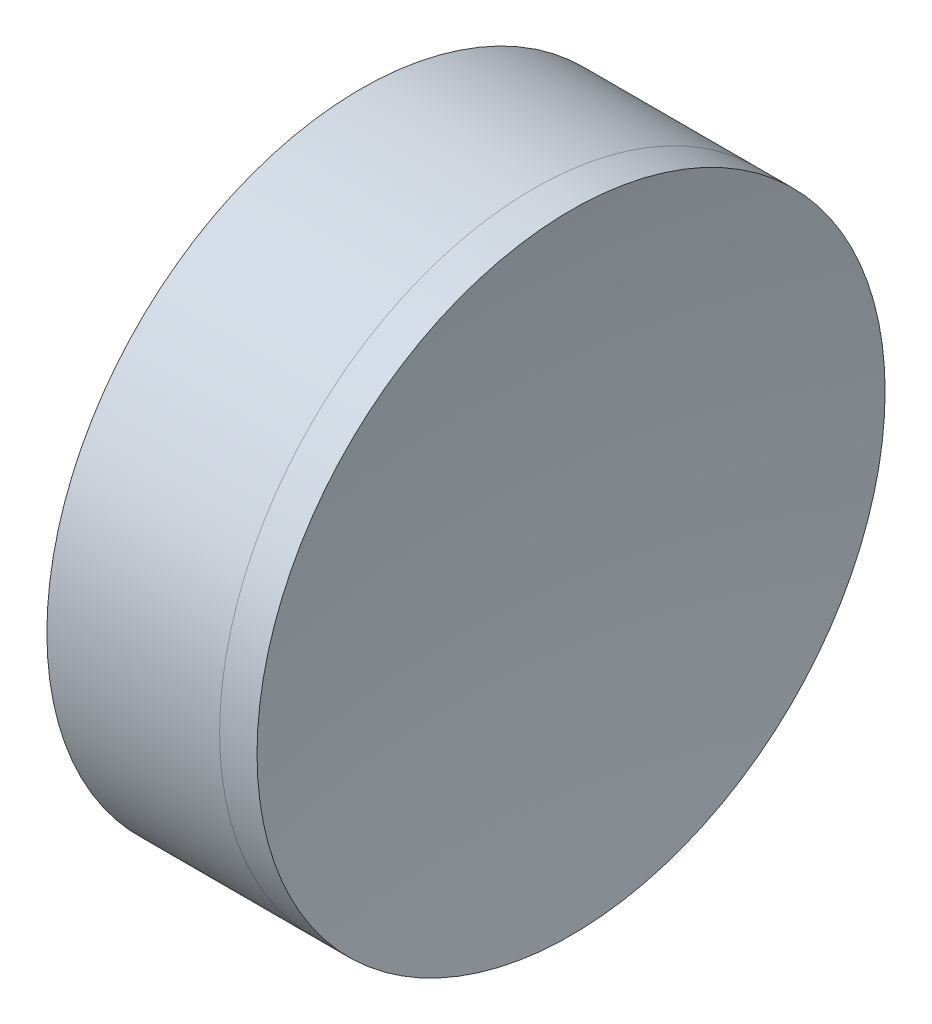
ISO-10303-21;
HEADER;
FILE_DESCRIPTION(('STEP AP214'),'2;1');
FILE_NAME('part.step','',(''),(''),'','','');
FILE_SCHEMA(('AUTOMOTIVE_DESIGN { 1 0 10303 214 1 1 1 1 }'));
ENDSEC;
DATA;
#1=APPLICATION_CONTEXT('core data for automotive mechanical design processes');
#2=APPLICATION_PROTOCOL_DEFINITION('international standard','automotive_design',2000,#1);
#3=PRODUCT_CONTEXT('',#1,'mechanical');
#4=PRODUCT('Part','Part','',(#3));
#5=PRODUCT_RELATED_PRODUCT_CATEGORY('part','',(#4));
#6=PRODUCT_DEFINITION_FORMATION('','',#4);
#7=PRODUCT_DEFINITION_CONTEXT('part definition',#1,'design');
#8=PRODUCT_DEFINITION('design','',#6,#7);
#9=PRODUCT_DEFINITION_SHAPE('','',#8);
#10=(LENGTH_UNIT() NAMED_UNIT(*) SI_UNIT(.MILLI.,.METRE.));
#11=(NAMED_UNIT(*) PLANE_ANGLE_UNIT() SI_UNIT($,.RADIAN.));
#12=(NAMED_UNIT(*) SI_UNIT($,.STERADIAN.) SOLID_ANGLE_UNIT());
#13=UNCERTAINTY_MEASURE_WITH_UNIT(LENGTH_MEASURE(1.E-05),#10,'distance_accuracy_value','');
#14=(GEOMETRIC_REPRESENTATION_CONTEXT(3) GLOBAL_UNCERTAINTY_ASSIGNED_CONTEXT((#13)) GLOBAL_UNIT_ASSIGNED_CONTEXT((#10,
#11,#12)) REPRESENTATION_CONTEXT('',''));
#15=CARTESIAN_POINT('',(0.,0.,0.));
#16=DIRECTION('',(0.,0.,1.));
#17=DIRECTION('',(1.,0.,0.));
#18=AXIS2_PLACEMENT_3D('',#15,#16,#17);
#19=CARTESIAN_POINT('',(297.310994613821,0.,0.));
#20=DIRECTION('',(-1.,0.,0.));
#21=DIRECTION('',(0.,0.,-1.));
#22=AXIS2_PLACEMENT_3D('',#19,#20,#21);
#23=SPHERICAL_SURFACE('',#22,40.9);
#24=CARTESIAN_POINT('',(261.634531784667,0.,0.));
#25=DIRECTION('',(-1.,0.,0.));
#26=DIRECTION('',(0.,0.,1.));
#27=AXIS2_PLACEMENT_3D('',#24,#25,#26);
#28=CIRCLE('',#27,20.);
#29=CARTESIAN_POINT('',(261.634531784667,0.,20.));
#30=VERTEX_POINT('',#29);
#31=EDGE_CURVE('E11',#30,#30,#28,.T.);
#32=ORIENTED_EDGE('',*,*,#31,.T.);
#33=EDGE_LOOP('',(#32));
#34=FACE_BOUND('',#33,.T.);
#35=ADVANCED_FACE('F45',(#34),#23,.T.);
#36=CARTESIAN_POINT('',(250.633803890604,0.,0.));
#37=DIRECTION('',(-1.,0.,0.));
#38=DIRECTION('',(0.,0.,1.));
#39=AXIS2_PLACEMENT_3D('',#36,#37,#38);
#40=CYLINDRICAL_SURFACE('',#39,20.);
#41=CARTESIAN_POINT('',(264.015516295071,0.,0.));
#42=DIRECTION('',(-1.,0.,0.));
#43=DIRECTION('',(0.,0.,1.));
#44=AXIS2_PLACEMENT_3D('',#41,#42,#43);
#45=CIRCLE('',#44,20.);
#46=CARTESIAN_POINT('',(264.015516295071,0.,20.));
#47=VERTEX_POINT('',#46);
#48=EDGE_CURVE('E51',#47,#47,#45,.T.);
#49=ORIENTED_EDGE('',*,*,#48,.T.);
#50=EDGE_LOOP('',(#49));
#51=FACE_BOUND('',#50,.T.);
#52=ORIENTED_EDGE('',*,*,#31,.F.);
#53=EDGE_LOOP('',(#52));
#54=FACE_BOUND('',#53,.T.);
#55=ADVANCED_FACE('F57',(#51,#54),#40,.T.);
#56=CARTESIAN_POINT('',(387.860994613821,0.,0.));
#57=DIRECTION('',(-1.,0.,0.));
#58=DIRECTION('',(0.,0.,-1.));
#59=AXIS2_PLACEMENT_3D('',#56,#57,#58);
#60=SPHERICAL_SURFACE('',#59,125.45);
#61=ORIENTED_EDGE('',*,*,#48,.F.);
#62=EDGE_LOOP('',(#61));
#63=FACE_BOUND('',#62,.T.);
#64=ADVANCED_FACE('F60',(#63),#60,.F.);
#65=CLOSED_SHELL('',(#35,#55,#64));
#66=MANIFOLD_SOLID_BREP('B2',#65);
#67=CARTESIAN_POINT('',(199.572994613821,0.,0.));
#68=DIRECTION('',(-1.,0.,0.));
#69=DIRECTION('',(0.,0.,1.));
#70=AXIS2_PLACEMENT_3D('',#67,#68,#69);
#71=SPHERICAL_SURFACE('',#70,54.838);
#72=CARTESIAN_POINT('',(250.633803890604,0.,0.));
#73=DIRECTION('',(-1.,0.,0.));
#74=DIRECTION('',(0.,0.,1.));
#75=AXIS2_PLACEMENT_3D('',#72,#73,#74);
#76=CIRCLE('',#75,20.);
#77=CARTESIAN_POINT('',(250.633803890604,0.,20.));
#78=VERTEX_POINT('',#77);
#79=EDGE_CURVE('E44',#78,#78,#76,.T.);
#80=ORIENTED_EDGE('',*,*,#79,.T.);
#81=EDGE_LOOP('',(#80));
#82=FACE_BOUND('',#81,.T.);
#83=ADVANCED_FACE('F86',(#82),#71,.F.);
#84=CARTESIAN_POINT('',(-0.816062176165804,0.,0.));
#85=DIRECTION('',(-1.,0.,0.));
#86=DIRECTION('',(0.,0.,1.));
#87=AXIS2_PLACEMENT_3D('',#84,#85,#86);
#88=CYLINDRICAL_SURFACE('',#87,20.);
#89=CARTESIAN_POINT('',(261.634531784667,0.,0.));
#90=DIRECTION('',(-1.,0.,0.));
#91=DIRECTION('',(0.,0.,1.));
#92=AXIS2_PLACEMENT_3D('',#89,#90,#91);
#93=CIRCLE('',#92,20.);
#94=CARTESIAN_POINT('',(261.634531784667,0.,20.));
#95=VERTEX_POINT('',#94);
#96=EDGE_CURVE('E92',#95,#95,#93,.T.);
#97=ORIENTED_EDGE('',*,*,#96,.T.);
#98=EDGE_LOOP('',(#97));
#99=FACE_BOUND('',#98,.T.);
#100=ORIENTED_EDGE('',*,*,#79,.F.);
#101=EDGE_LOOP('',(#100));
#102=FACE_BOUND('',#101,.T.);
#103=ADVANCED_FACE('F98',(#99,#102),#88,.T.);
#104=CARTESIAN_POINT('',(297.310994613821,0.,0.));
#105=DIRECTION('',(-1.,0.,0.));
#106=DIRECTION('',(0.,0.,-1.));
#107=AXIS2_PLACEMENT_3D('',#104,#105,#106);
#108=SPHERICAL_SURFACE('',#107,40.9);
#109=ORIENTED_EDGE('',*,*,#96,.F.);
#110=EDGE_LOOP('',(#109));
#111=FACE_BOUND('',#110,.T.);
#112=ADVANCED_FACE('F101',(#111),#108,.F.);
#113=CLOSED_SHELL('',(#83,#103,#112));
#114=MANIFOLD_SOLID_BREP('B6',#113);
#115=ADVANCED_BREP_SHAPE_REPRESENTATION('',(#18,#66,#114),#14);
#116=SHAPE_DEFINITION_REPRESENTATION(#9,#115);
ENDSEC;
END-ISO-10303-21;
